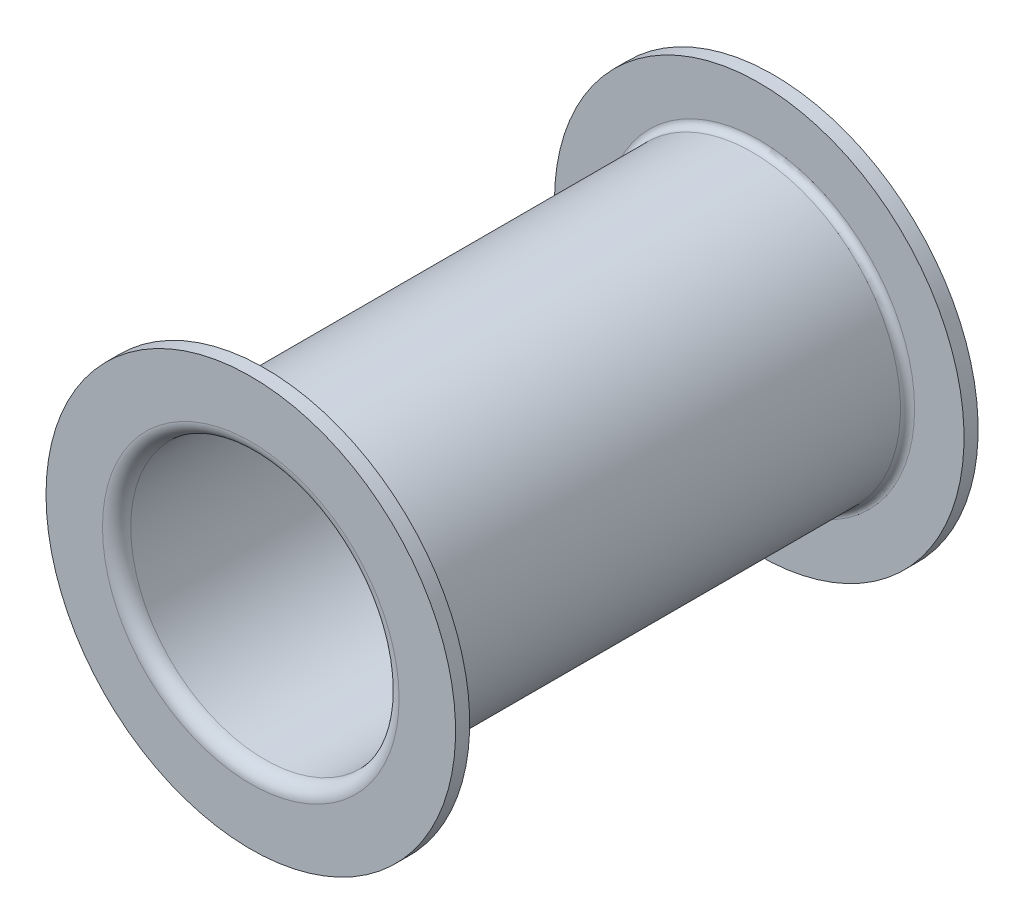
ISO-10303-21;
HEADER;
FILE_DESCRIPTION(('STEP AP214'),'2;1');
FILE_NAME('part.step','',(''),(''),'','','');
FILE_SCHEMA(('AUTOMOTIVE_DESIGN { 1 0 10303 214 1 1 1 1 }'));
ENDSEC;
DATA;
#1=APPLICATION_CONTEXT('core data for automotive mechanical design processes');
#2=APPLICATION_PROTOCOL_DEFINITION('international standard','automotive_design',2000,#1);
#3=PRODUCT_CONTEXT('',#1,'mechanical');
#4=PRODUCT('Part','Part','',(#3));
#5=PRODUCT_RELATED_PRODUCT_CATEGORY('part','',(#4));
#6=PRODUCT_DEFINITION_FORMATION('','',#4);
#7=PRODUCT_DEFINITION_CONTEXT('part definition',#1,'design');
#8=PRODUCT_DEFINITION('design','',#6,#7);
#9=PRODUCT_DEFINITION_SHAPE('','',#8);
#10=(LENGTH_UNIT() NAMED_UNIT(*) SI_UNIT(.MILLI.,.METRE.));
#11=(NAMED_UNIT(*) PLANE_ANGLE_UNIT() SI_UNIT($,.RADIAN.));
#12=(NAMED_UNIT(*) SI_UNIT($,.STERADIAN.) SOLID_ANGLE_UNIT());
#13=UNCERTAINTY_MEASURE_WITH_UNIT(LENGTH_MEASURE(1.E-05),#10,'distance_accuracy_value','');
#14=(GEOMETRIC_REPRESENTATION_CONTEXT(3) GLOBAL_UNCERTAINTY_ASSIGNED_CONTEXT((#13)) GLOBAL_UNIT_ASSIGNED_CONTEXT((#10,
#11,#12)) REPRESENTATION_CONTEXT('',''));
#15=CARTESIAN_POINT('',(0.,0.,0.));
#16=DIRECTION('',(0.,0.,1.));
#17=DIRECTION('',(1.,0.,0.));
#18=AXIS2_PLACEMENT_3D('',#15,#16,#17);
#19=CARTESIAN_POINT('',(0.,0.,-0.612201912718));
#20=DIRECTION('',(0.,0.,-1.));
#21=DIRECTION('',(-1.,0.,0.));
#22=AXIS2_PLACEMENT_3D('',#19,#20,#21);
#23=CYLINDRICAL_SURFACE('',#22,0.19);
#24=CARTESIAN_POINT('',(0.,0.,-0.72));
#25=DIRECTION('',(0.,0.,-1.));
#26=DIRECTION('',(-1.,0.,0.));
#27=AXIS2_PLACEMENT_3D('',#24,#25,#26);
#28=CIRCLE('',#27,0.19);
#29=CARTESIAN_POINT('',(-0.19,0.,-0.72));
#30=VERTEX_POINT('',#29);
#31=EDGE_CURVE('E64',#30,#30,#28,.F.);
#32=ORIENTED_EDGE('',*,*,#31,.F.);
#33=EDGE_LOOP('',(#32));
#34=FACE_BOUND('',#33,.T.);
#35=CARTESIAN_POINT('',(0.,0.,-0.02));
#36=DIRECTION('',(0.,0.,-1.));
#37=DIRECTION('',(-1.,0.,0.));
#38=AXIS2_PLACEMENT_3D('',#35,#36,#37);
#39=CIRCLE('',#38,0.19);
#40=CARTESIAN_POINT('',(-0.19,0.,-0.02));
#41=VERTEX_POINT('',#40);
#42=EDGE_CURVE('E259',#41,#41,#39,.T.);
#43=ORIENTED_EDGE('',*,*,#42,.F.);
#44=EDGE_LOOP('',(#43));
#45=FACE_BOUND('',#44,.T.);
#46=ADVANCED_FACE('F17',(#34,#45),#23,.F.);
#47=CARTESIAN_POINT('',(0.,0.,-0.02));
#48=DIRECTION('',(0.,0.,-1.));
#49=DIRECTION('',(-1.,0.,0.));
#50=AXIS2_PLACEMENT_3D('',#47,#48,#49);
#51=TOROIDAL_SURFACE('',#50,0.21,0.02);
#52=CARTESIAN_POINT('',(0.,0.,0.));
#53=DIRECTION('',(0.,0.,1.));
#54=DIRECTION('',(-1.,0.,0.));
#55=AXIS2_PLACEMENT_3D('',#52,#53,#54);
#56=CIRCLE('',#55,0.21);
#57=CARTESIAN_POINT('',(-0.21,0.,0.));
#58=VERTEX_POINT('',#57);
#59=CARTESIAN_POINT('',(0.21,0.,0.));
#60=VERTEX_POINT('',#59);
#61=EDGE_CURVE('E59',#58,#60,#56,.T.);
#62=ORIENTED_EDGE('',*,*,#61,.T.);
#63=CARTESIAN_POINT('',(0.,0.,0.));
#64=DIRECTION('',(0.,0.,1.));
#65=DIRECTION('',(1.,0.,0.));
#66=AXIS2_PLACEMENT_3D('',#63,#64,#65);
#67=CIRCLE('',#66,0.21);
#68=EDGE_CURVE('E56',#60,#58,#67,.T.);
#69=ORIENTED_EDGE('',*,*,#68,.T.);
#70=EDGE_LOOP('',(#62,#69));
#71=FACE_BOUND('',#70,.T.);
#72=ORIENTED_EDGE('',*,*,#42,.T.);
#73=EDGE_LOOP('',(#72));
#74=FACE_BOUND('',#73,.T.);
#75=ADVANCED_FACE('F60',(#71,#74),#51,.T.);
#76=CARTESIAN_POINT('',(0.,0.,-0.72));
#77=DIRECTION('',(0.,0.,-1.));
#78=DIRECTION('',(-1.,0.,0.));
#79=AXIS2_PLACEMENT_3D('',#76,#77,#78);
#80=TOROIDAL_SURFACE('',#79,0.21,0.02);
#81=ORIENTED_EDGE('',*,*,#31,.T.);
#82=EDGE_LOOP('',(#81));
#83=FACE_BOUND('',#82,.T.);
#84=CARTESIAN_POINT('',(0.,0.,-0.74));
#85=DIRECTION('',(0.,0.,-1.));
#86=DIRECTION('',(-1.,0.,0.));
#87=AXIS2_PLACEMENT_3D('',#84,#85,#86);
#88=CIRCLE('',#87,0.21);
#89=CARTESIAN_POINT('',(-0.21,0.,-0.74));
#90=VERTEX_POINT('',#89);
#91=CARTESIAN_POINT('',(0.21,0.,-0.74));
#92=VERTEX_POINT('',#91);
#93=EDGE_CURVE('E225',#90,#92,#88,.T.);
#94=ORIENTED_EDGE('',*,*,#93,.T.);
#95=CARTESIAN_POINT('',(0.,0.,-0.74));
#96=DIRECTION('',(0.,0.,-1.));
#97=DIRECTION('',(1.,0.,0.));
#98=AXIS2_PLACEMENT_3D('',#95,#96,#97);
#99=CIRCLE('',#98,0.21);
#100=EDGE_CURVE('E69',#92,#90,#99,.T.);
#101=ORIENTED_EDGE('',*,*,#100,.T.);
#102=EDGE_LOOP('',(#94,#101));
#103=FACE_BOUND('',#102,.T.);
#104=ADVANCED_FACE('F90',(#83,#103),#80,.T.);
#105=CARTESIAN_POINT('',(0.21,0.,0.));
#106=DIRECTION('',(0.,0.,-1.));
#107=DIRECTION('',(-1.,0.,0.));
#108=AXIS2_PLACEMENT_3D('',#105,#106,#107);
#109=PLANE('',#108);
#110=ORIENTED_EDGE('',*,*,#61,.F.);
#111=ORIENTED_EDGE('',*,*,#68,.F.);
#112=EDGE_LOOP('',(#110,#111));
#113=FACE_BOUND('',#112,.T.);
#114=CARTESIAN_POINT('',(0.,0.,0.));
#115=DIRECTION('',(0.,0.,-1.));
#116=DIRECTION('',(-1.,0.,0.));
#117=AXIS2_PLACEMENT_3D('',#114,#115,#116);
#118=CIRCLE('',#117,0.29);
#119=CARTESIAN_POINT('',(-0.29,0.,0.));
#120=VERTEX_POINT('',#119);
#121=EDGE_CURVE('E233',#120,#120,#118,.T.);
#122=ORIENTED_EDGE('',*,*,#121,.F.);
#123=EDGE_LOOP('',(#122));
#124=FACE_BOUND('',#123,.T.);
#125=ADVANCED_FACE('F67',(#113,#124),#109,.F.);
#126=CARTESIAN_POINT('',(0.29,0.,-0.74));
#127=DIRECTION('',(0.,0.,1.));
#128=DIRECTION('',(1.,0.,0.));
#129=AXIS2_PLACEMENT_3D('',#126,#127,#128);
#130=PLANE('',#129);
#131=CARTESIAN_POINT('',(0.,0.,-0.74));
#132=DIRECTION('',(0.,0.,-1.));
#133=DIRECTION('',(-1.,0.,0.));
#134=AXIS2_PLACEMENT_3D('',#131,#132,#133);
#135=CIRCLE('',#134,0.29);
#136=CARTESIAN_POINT('',(-0.29,0.,-0.74));
#137=VERTEX_POINT('',#136);
#138=EDGE_CURVE('E235',#137,#137,#135,.F.);
#139=ORIENTED_EDGE('',*,*,#138,.F.);
#140=EDGE_LOOP('',(#139));
#141=FACE_BOUND('',#140,.T.);
#142=ORIENTED_EDGE('',*,*,#100,.F.);
#143=ORIENTED_EDGE('',*,*,#93,.F.);
#144=EDGE_LOOP('',(#142,#143));
#145=FACE_BOUND('',#144,.T.);
#146=ADVANCED_FACE('F89',(#141,#145),#130,.F.);
#147=CARTESIAN_POINT('',(0.,0.,-0.612201912718));
#148=DIRECTION('',(0.,0.,-1.));
#149=DIRECTION('',(-1.,0.,0.));
#150=AXIS2_PLACEMENT_3D('',#147,#148,#149);
#151=CYLINDRICAL_SURFACE('',#150,0.29);
#152=CARTESIAN_POINT('',(0.,0.,-0.0200000000000001));
#153=DIRECTION('',(0.,0.,-1.));
#154=DIRECTION('',(-1.,0.,0.));
#155=AXIS2_PLACEMENT_3D('',#152,#153,#154);
#156=CIRCLE('',#155,0.29);
#157=CARTESIAN_POINT('',(-0.29,0.,-0.0200000000000001));
#158=VERTEX_POINT('',#157);
#159=EDGE_CURVE('E240',#158,#158,#156,.F.);
#160=ORIENTED_EDGE('',*,*,#159,.T.);
#161=EDGE_LOOP('',(#160));
#162=FACE_BOUND('',#161,.T.);
#163=ORIENTED_EDGE('',*,*,#121,.T.);
#164=EDGE_LOOP('',(#163));
#165=FACE_BOUND('',#164,.T.);
#166=ADVANCED_FACE('F314',(#162,#165),#151,.T.);
#167=CARTESIAN_POINT('',(0.,0.,-0.612201912718));
#168=DIRECTION('',(0.,0.,-1.));
#169=DIRECTION('',(-1.,0.,0.));
#170=AXIS2_PLACEMENT_3D('',#167,#168,#169);
#171=CYLINDRICAL_SURFACE('',#170,0.29);
#172=ORIENTED_EDGE('',*,*,#138,.T.);
#173=EDGE_LOOP('',(#172));
#174=FACE_BOUND('',#173,.T.);
#175=CARTESIAN_POINT('',(0.,0.,-0.72));
#176=DIRECTION('',(0.,0.,-1.));
#177=DIRECTION('',(-1.,0.,0.));
#178=AXIS2_PLACEMENT_3D('',#175,#176,#177);
#179=CIRCLE('',#178,0.29);
#180=CARTESIAN_POINT('',(-0.29,0.,-0.72));
#181=VERTEX_POINT('',#180);
#182=EDGE_CURVE('E252',#181,#181,#179,.T.);
#183=ORIENTED_EDGE('',*,*,#182,.T.);
#184=EDGE_LOOP('',(#183));
#185=FACE_BOUND('',#184,.T.);
#186=ADVANCED_FACE('F193',(#174,#185),#171,.T.);
#187=CARTESIAN_POINT('',(0.29,0.,-0.02));
#188=DIRECTION('',(0.,0.,1.));
#189=DIRECTION('',(1.,0.,0.));
#190=AXIS2_PLACEMENT_3D('',#187,#188,#189);
#191=PLANE('',#190);
#192=ORIENTED_EDGE('',*,*,#159,.F.);
#193=EDGE_LOOP('',(#192));
#194=FACE_BOUND('',#193,.T.);
#195=CARTESIAN_POINT('',(0.,0.,-0.02));
#196=DIRECTION('',(0.,0.,-1.));
#197=DIRECTION('',(1.,0.,0.));
#198=AXIS2_PLACEMENT_3D('',#195,#196,#197);
#199=CIRCLE('',#198,0.22);
#200=CARTESIAN_POINT('',(-0.22,0.,-0.02));
#201=VERTEX_POINT('',#200);
#202=CARTESIAN_POINT('',(0.22,0.,-0.02));
#203=VERTEX_POINT('',#202);
#204=EDGE_CURVE('E178',#201,#203,#199,.F.);
#205=ORIENTED_EDGE('',*,*,#204,.T.);
#206=CARTESIAN_POINT('',(0.,0.,-0.02));
#207=DIRECTION('',(0.,0.,-1.));
#208=DIRECTION('',(-1.,0.,0.));
#209=AXIS2_PLACEMENT_3D('',#206,#207,#208);
#210=CIRCLE('',#209,0.22);
#211=EDGE_CURVE('E205',#203,#201,#210,.F.);
#212=ORIENTED_EDGE('',*,*,#211,.T.);
#213=EDGE_LOOP('',(#205,#212));
#214=FACE_BOUND('',#213,.T.);
#215=ADVANCED_FACE('F184',(#194,#214),#191,.F.);
#216=CARTESIAN_POINT('',(0.22,0.,-0.72));
#217=DIRECTION('',(0.,0.,-1.));
#218=DIRECTION('',(-1.,0.,0.));
#219=AXIS2_PLACEMENT_3D('',#216,#217,#218);
#220=PLANE('',#219);
#221=CARTESIAN_POINT('',(0.,0.,-0.72));
#222=DIRECTION('',(0.,0.,1.));
#223=DIRECTION('',(-1.,0.,0.));
#224=AXIS2_PLACEMENT_3D('',#221,#222,#223);
#225=CIRCLE('',#224,0.22);
#226=CARTESIAN_POINT('',(0.22,0.,-0.72));
#227=VERTEX_POINT('',#226);
#228=CARTESIAN_POINT('',(-0.22,0.,-0.72));
#229=VERTEX_POINT('',#228);
#230=EDGE_CURVE('E147',#227,#229,#225,.F.);
#231=ORIENTED_EDGE('',*,*,#230,.T.);
#232=CARTESIAN_POINT('',(0.,0.,-0.72));
#233=DIRECTION('',(0.,0.,1.));
#234=DIRECTION('',(1.,0.,0.));
#235=AXIS2_PLACEMENT_3D('',#232,#233,#234);
#236=CIRCLE('',#235,0.22);
#237=EDGE_CURVE('E35',#229,#227,#236,.F.);
#238=ORIENTED_EDGE('',*,*,#237,.T.);
#239=EDGE_LOOP('',(#231,#238));
#240=FACE_BOUND('',#239,.T.);
#241=ORIENTED_EDGE('',*,*,#182,.F.);
#242=EDGE_LOOP('',(#241));
#243=FACE_BOUND('',#242,.T.);
#244=ADVANCED_FACE('F133',(#240,#243),#220,.F.);
#245=CARTESIAN_POINT('',(0.,0.,-0.03));
#246=DIRECTION('',(0.,0.,-1.));
#247=DIRECTION('',(-1.,0.,0.));
#248=AXIS2_PLACEMENT_3D('',#245,#246,#247);
#249=TOROIDAL_SURFACE('',#248,0.22,0.01);
#250=CARTESIAN_POINT('',(0.,0.,-0.03));
#251=DIRECTION('',(0.,0.,-1.));
#252=DIRECTION('',(-1.,0.,0.));
#253=AXIS2_PLACEMENT_3D('',#250,#251,#252);
#254=CIRCLE('',#253,0.21);
#255=CARTESIAN_POINT('',(-0.21,0.,-0.03));
#256=VERTEX_POINT('',#255);
#257=EDGE_CURVE('E27',#256,#256,#254,.T.);
#258=ORIENTED_EDGE('',*,*,#257,.F.);
#259=EDGE_LOOP('',(#258));
#260=FACE_BOUND('',#259,.T.);
#261=ORIENTED_EDGE('',*,*,#204,.F.);
#262=ORIENTED_EDGE('',*,*,#211,.F.);
#263=EDGE_LOOP('',(#261,#262));
#264=FACE_BOUND('',#263,.T.);
#265=ADVANCED_FACE('F121',(#260,#264),#249,.F.);
#266=CARTESIAN_POINT('',(0.,0.,-0.71));
#267=DIRECTION('',(0.,0.,-1.));
#268=DIRECTION('',(-1.,0.,0.));
#269=AXIS2_PLACEMENT_3D('',#266,#267,#268);
#270=TOROIDAL_SURFACE('',#269,0.22,0.01);
#271=ORIENTED_EDGE('',*,*,#237,.F.);
#272=ORIENTED_EDGE('',*,*,#230,.F.);
#273=EDGE_LOOP('',(#271,#272));
#274=FACE_BOUND('',#273,.T.);
#275=CARTESIAN_POINT('',(0.,0.,-0.71));
#276=DIRECTION('',(0.,0.,-1.));
#277=DIRECTION('',(-1.,0.,0.));
#278=AXIS2_PLACEMENT_3D('',#275,#276,#277);
#279=CIRCLE('',#278,0.21);
#280=CARTESIAN_POINT('',(-0.21,0.,-0.71));
#281=VERTEX_POINT('',#280);
#282=EDGE_CURVE('E11',#281,#281,#279,.F.);
#283=ORIENTED_EDGE('',*,*,#282,.F.);
#284=EDGE_LOOP('',(#283));
#285=FACE_BOUND('',#284,.T.);
#286=ADVANCED_FACE('F132',(#274,#285),#270,.F.);
#287=CARTESIAN_POINT('',(0.,0.,-0.612201912718));
#288=DIRECTION('',(0.,0.,-1.));
#289=DIRECTION('',(-1.,0.,0.));
#290=AXIS2_PLACEMENT_3D('',#287,#288,#289);
#291=CYLINDRICAL_SURFACE('',#290,0.21);
#292=ORIENTED_EDGE('',*,*,#282,.T.);
#293=EDGE_LOOP('',(#292));
#294=FACE_BOUND('',#293,.T.);
#295=ORIENTED_EDGE('',*,*,#257,.T.);
#296=EDGE_LOOP('',(#295));
#297=FACE_BOUND('',#296,.T.);
#298=ADVANCED_FACE('F281',(#294,#297),#291,.T.);
#299=CLOSED_SHELL('',(#46,#75,#104,#125,#146,#166,#186,#215,#244,#265,#286,#298));
#300=MANIFOLD_SOLID_BREP('B1',#299);
#301=ADVANCED_BREP_SHAPE_REPRESENTATION('',(#18,#300),#14);
#302=SHAPE_DEFINITION_REPRESENTATION(#9,#301);
ENDSEC;
END-ISO-10303-21;
